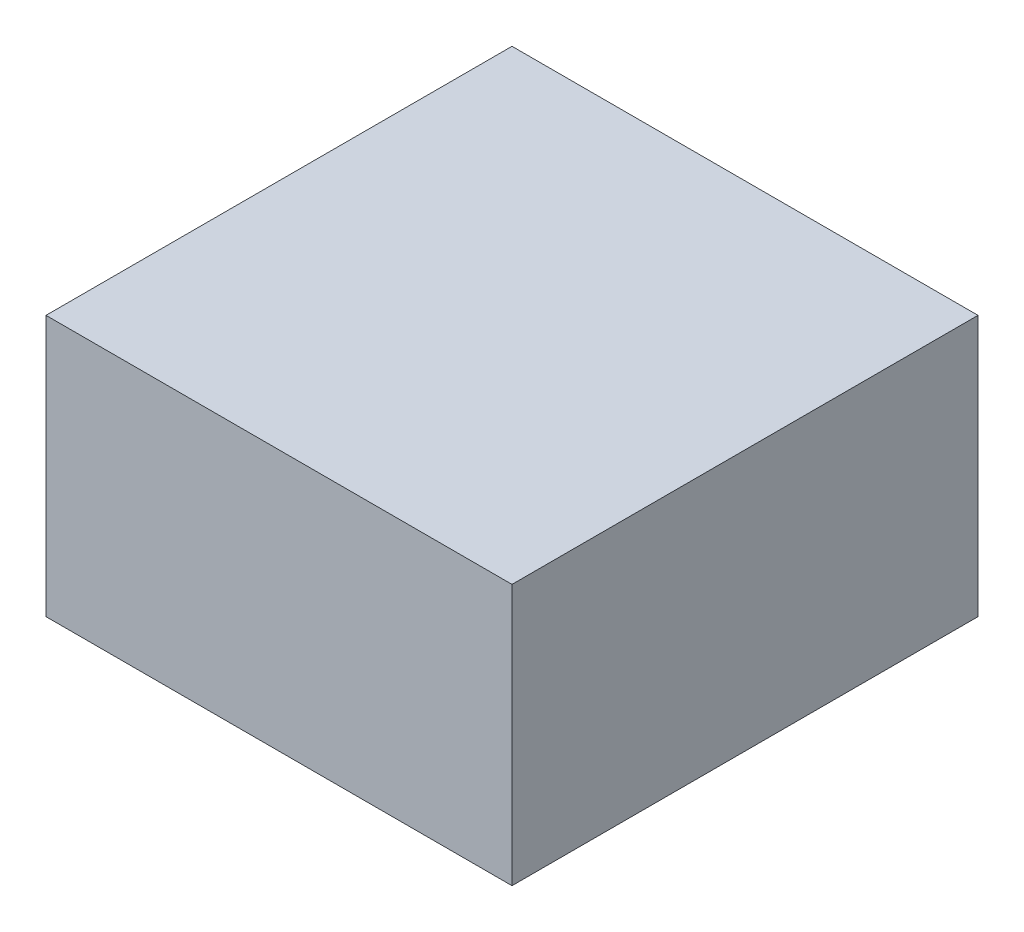
ISO-10303-21;
HEADER;
FILE_DESCRIPTION(('STEP AP214'),'2;1');
FILE_NAME('part.step','',(''),(''),'','','');
FILE_SCHEMA(('AUTOMOTIVE_DESIGN { 1 0 10303 214 1 1 1 1 }'));
ENDSEC;
DATA;
#1=APPLICATION_CONTEXT('core data for automotive mechanical design processes');
#2=APPLICATION_PROTOCOL_DEFINITION('international standard','automotive_design',2000,#1);
#3=PRODUCT_CONTEXT('',#1,'mechanical');
#4=PRODUCT('Part','Part','',(#3));
#5=PRODUCT_RELATED_PRODUCT_CATEGORY('part','',(#4));
#6=PRODUCT_DEFINITION_FORMATION('','',#4);
#7=PRODUCT_DEFINITION_CONTEXT('part definition',#1,'design');
#8=PRODUCT_DEFINITION('design','',#6,#7);
#9=PRODUCT_DEFINITION_SHAPE('','',#8);
#10=(LENGTH_UNIT() NAMED_UNIT(*) SI_UNIT(.MILLI.,.METRE.));
#11=(NAMED_UNIT(*) PLANE_ANGLE_UNIT() SI_UNIT($,.RADIAN.));
#12=(NAMED_UNIT(*) SI_UNIT($,.STERADIAN.) SOLID_ANGLE_UNIT());
#13=UNCERTAINTY_MEASURE_WITH_UNIT(LENGTH_MEASURE(1.E-05),#10,'distance_accuracy_value','');
#14=(GEOMETRIC_REPRESENTATION_CONTEXT(3) GLOBAL_UNCERTAINTY_ASSIGNED_CONTEXT((#13)) GLOBAL_UNIT_ASSIGNED_CONTEXT((#10,
#11,#12)) REPRESENTATION_CONTEXT('',''));
#15=CARTESIAN_POINT('',(0.,0.,0.));
#16=DIRECTION('',(0.,0.,1.));
#17=DIRECTION('',(1.,0.,0.));
#18=AXIS2_PLACEMENT_3D('',#15,#16,#17);
#19=CARTESIAN_POINT('',(0.,0.14,0.));
#20=DIRECTION('',(0.,1.,0.));
#21=DIRECTION('',(1.,0.,0.));
#22=AXIS2_PLACEMENT_3D('',#19,#20,#21);
#23=PLANE('',#22);
#24=DIRECTION('',(1.,0.,0.));
#25=VECTOR('',#24,1.);
#26=CARTESIAN_POINT('',(-0.125,0.14,0.25));
#27=LINE('',#26,#25);
#28=CARTESIAN_POINT('',(-0.125,0.14,0.25));
#29=VERTEX_POINT('',#28);
#30=CARTESIAN_POINT('',(0.125,0.14,0.25));
#31=VERTEX_POINT('',#30);
#32=EDGE_CURVE('E11',#29,#31,#27,.T.);
#33=ORIENTED_EDGE('',*,*,#32,.T.);
#34=DIRECTION('',(0.,0.,-1.));
#35=VECTOR('',#34,1.);
#36=CARTESIAN_POINT('',(0.125,0.14,0.25));
#37=LINE('',#36,#35);
#38=CARTESIAN_POINT('',(0.125,0.14,0.));
#39=VERTEX_POINT('',#38);
#40=EDGE_CURVE('E43',#31,#39,#37,.T.);
#41=ORIENTED_EDGE('',*,*,#40,.T.);
#42=DIRECTION('',(-1.,0.,0.));
#43=VECTOR('',#42,1.);
#44=CARTESIAN_POINT('',(0.125,0.14,0.));
#45=LINE('',#44,#43);
#46=CARTESIAN_POINT('',(-0.125,0.14,0.));
#47=VERTEX_POINT('',#46);
#48=EDGE_CURVE('E76',#39,#47,#45,.T.);
#49=ORIENTED_EDGE('',*,*,#48,.T.);
#50=DIRECTION('',(0.,0.,1.));
#51=VECTOR('',#50,1.);
#52=CARTESIAN_POINT('',(-0.125,0.14,0.));
#53=LINE('',#52,#51);
#54=EDGE_CURVE('E107',#47,#29,#53,.T.);
#55=ORIENTED_EDGE('',*,*,#54,.T.);
#56=EDGE_LOOP('',(#33,#41,#49,#55));
#57=FACE_BOUND('',#56,.T.);
#58=ADVANCED_FACE('F17',(#57),#23,.T.);
#59=CARTESIAN_POINT('',(-0.125,0.,0.25));
#60=DIRECTION('',(0.,0.,1.));
#61=DIRECTION('',(1.,0.,0.));
#62=AXIS2_PLACEMENT_3D('',#59,#60,#61);
#63=PLANE('',#62);
#64=DIRECTION('',(0.,1.,0.));
#65=VECTOR('',#64,1.);
#66=CARTESIAN_POINT('',(0.125,0.,0.25));
#67=LINE('',#66,#65);
#68=CARTESIAN_POINT('',(0.125,0.,0.25));
#69=VERTEX_POINT('',#68);
#70=EDGE_CURVE('E26',#69,#31,#67,.T.);
#71=ORIENTED_EDGE('',*,*,#70,.T.);
#72=ORIENTED_EDGE('',*,*,#32,.F.);
#73=DIRECTION('',(0.,1.,0.));
#74=VECTOR('',#73,1.);
#75=CARTESIAN_POINT('',(-0.125,0.,0.25));
#76=LINE('',#75,#74);
#77=CARTESIAN_POINT('',(-0.125,0.,0.25));
#78=VERTEX_POINT('',#77);
#79=EDGE_CURVE('E103',#78,#29,#76,.T.);
#80=ORIENTED_EDGE('',*,*,#79,.F.);
#81=DIRECTION('',(1.,0.,0.));
#82=VECTOR('',#81,1.);
#83=CARTESIAN_POINT('',(-0.125,0.,0.25));
#84=LINE('',#83,#82);
#85=EDGE_CURVE('E87',#78,#69,#84,.T.);
#86=ORIENTED_EDGE('',*,*,#85,.T.);
#87=EDGE_LOOP('',(#71,#72,#80,#86));
#88=FACE_BOUND('',#87,.T.);
#89=ADVANCED_FACE('F19',(#88),#63,.T.);
#90=CARTESIAN_POINT('',(0.125,0.,0.25));
#91=DIRECTION('',(1.,0.,0.));
#92=DIRECTION('',(0.,1.,0.));
#93=AXIS2_PLACEMENT_3D('',#90,#91,#92);
#94=PLANE('',#93);
#95=DIRECTION('',(0.,1.,0.));
#96=VECTOR('',#95,1.);
#97=CARTESIAN_POINT('',(0.125,0.,0.));
#98=LINE('',#97,#96);
#99=CARTESIAN_POINT('',(0.125,0.,0.));
#100=VERTEX_POINT('',#99);
#101=EDGE_CURVE('E70',#100,#39,#98,.T.);
#102=ORIENTED_EDGE('',*,*,#101,.T.);
#103=ORIENTED_EDGE('',*,*,#40,.F.);
#104=ORIENTED_EDGE('',*,*,#70,.F.);
#105=DIRECTION('',(0.,0.,-1.));
#106=VECTOR('',#105,1.);
#107=CARTESIAN_POINT('',(0.125,0.,0.25));
#108=LINE('',#107,#106);
#109=EDGE_CURVE('E81',#69,#100,#108,.T.);
#110=ORIENTED_EDGE('',*,*,#109,.T.);
#111=EDGE_LOOP('',(#102,#103,#104,#110));
#112=FACE_BOUND('',#111,.T.);
#113=ADVANCED_FACE('F82',(#112),#94,.T.);
#114=CARTESIAN_POINT('',(0.125,0.,0.));
#115=DIRECTION('',(0.,0.,-1.));
#116=DIRECTION('',(0.,-1.,0.));
#117=AXIS2_PLACEMENT_3D('',#114,#115,#116);
#118=PLANE('',#117);
#119=DIRECTION('',(0.,1.,0.));
#120=VECTOR('',#119,1.);
#121=CARTESIAN_POINT('',(-0.125,0.,0.));
#122=LINE('',#121,#120);
#123=CARTESIAN_POINT('',(-0.125,0.,0.));
#124=VERTEX_POINT('',#123);
#125=EDGE_CURVE('E110',#124,#47,#122,.T.);
#126=ORIENTED_EDGE('',*,*,#125,.T.);
#127=ORIENTED_EDGE('',*,*,#48,.F.);
#128=ORIENTED_EDGE('',*,*,#101,.F.);
#129=DIRECTION('',(-1.,0.,0.));
#130=VECTOR('',#129,1.);
#131=CARTESIAN_POINT('',(0.125,0.,0.));
#132=LINE('',#131,#130);
#133=EDGE_CURVE('E75',#100,#124,#132,.T.);
#134=ORIENTED_EDGE('',*,*,#133,.T.);
#135=EDGE_LOOP('',(#126,#127,#128,#134));
#136=FACE_BOUND('',#135,.T.);
#137=ADVANCED_FACE('F73',(#136),#118,.T.);
#138=CARTESIAN_POINT('',(-0.125,0.,0.));
#139=DIRECTION('',(-1.,0.,0.));
#140=DIRECTION('',(0.,0.,1.));
#141=AXIS2_PLACEMENT_3D('',#138,#139,#140);
#142=PLANE('',#141);
#143=ORIENTED_EDGE('',*,*,#79,.T.);
#144=ORIENTED_EDGE('',*,*,#54,.F.);
#145=ORIENTED_EDGE('',*,*,#125,.F.);
#146=DIRECTION('',(0.,0.,1.));
#147=VECTOR('',#146,1.);
#148=CARTESIAN_POINT('',(-0.125,0.,0.));
#149=LINE('',#148,#147);
#150=EDGE_CURVE('E92',#124,#78,#149,.T.);
#151=ORIENTED_EDGE('',*,*,#150,.T.);
#152=EDGE_LOOP('',(#143,#144,#145,#151));
#153=FACE_BOUND('',#152,.T.);
#154=ADVANCED_FACE('F161',(#153),#142,.T.);
#155=CARTESIAN_POINT('',(0.,0.,0.));
#156=DIRECTION('',(0.,1.,0.));
#157=DIRECTION('',(1.,0.,0.));
#158=AXIS2_PLACEMENT_3D('',#155,#156,#157);
#159=PLANE('',#158);
#160=ORIENTED_EDGE('',*,*,#133,.F.);
#161=ORIENTED_EDGE('',*,*,#109,.F.);
#162=ORIENTED_EDGE('',*,*,#85,.F.);
#163=ORIENTED_EDGE('',*,*,#150,.F.);
#164=EDGE_LOOP('',(#160,#161,#162,#163));
#165=FACE_BOUND('',#164,.T.);
#166=ADVANCED_FACE('F90',(#165),#159,.F.);
#167=CLOSED_SHELL('',(#58,#89,#113,#137,#154,#166));
#168=MANIFOLD_SOLID_BREP('B1',#167);
#169=ADVANCED_BREP_SHAPE_REPRESENTATION('',(#18,#168),#14);
#170=SHAPE_DEFINITION_REPRESENTATION(#9,#169);
ENDSEC;
END-ISO-10303-21;
